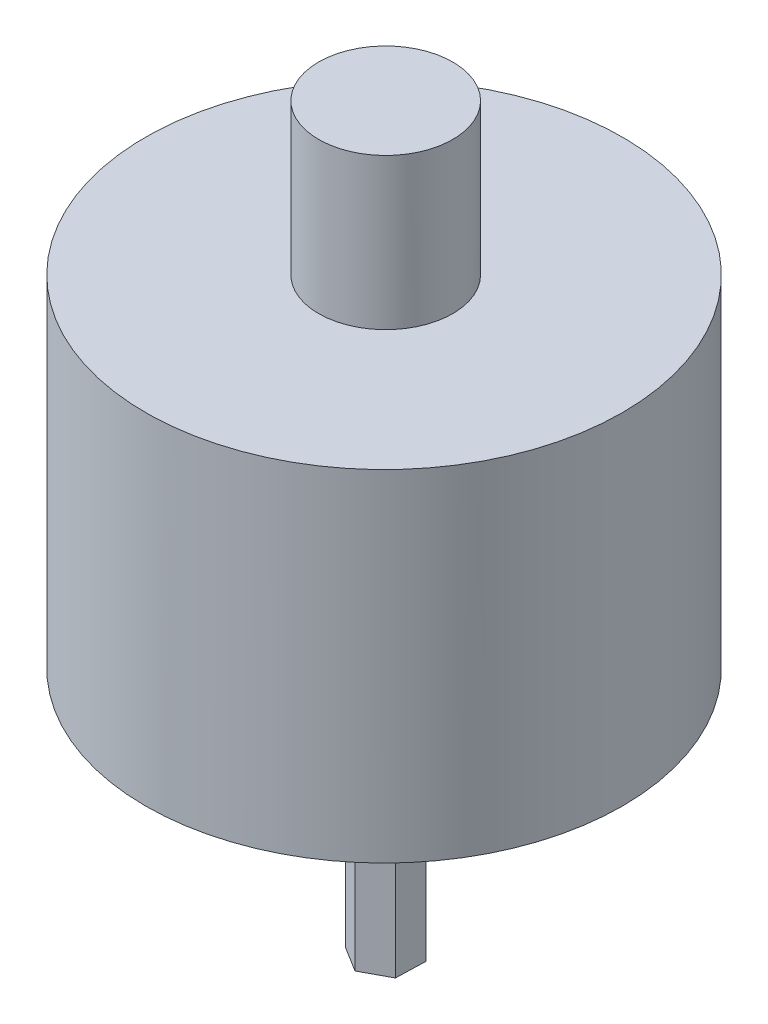
ISO-10303-21;
HEADER;
FILE_DESCRIPTION(('STEP AP214'),'2;1');
FILE_NAME('part.step','',(''),(''),'','','');
FILE_SCHEMA(('AUTOMOTIVE_DESIGN { 1 0 10303 214 1 1 1 1 }'));
ENDSEC;
DATA;
#1=APPLICATION_CONTEXT('core data for automotive mechanical design processes');
#2=APPLICATION_PROTOCOL_DEFINITION('international standard','automotive_design',2000,#1);
#3=PRODUCT_CONTEXT('',#1,'mechanical');
#4=PRODUCT('Part','Part','',(#3));
#5=PRODUCT_RELATED_PRODUCT_CATEGORY('part','',(#4));
#6=PRODUCT_DEFINITION_FORMATION('','',#4);
#7=PRODUCT_DEFINITION_CONTEXT('part definition',#1,'design');
#8=PRODUCT_DEFINITION('design','',#6,#7);
#9=PRODUCT_DEFINITION_SHAPE('','',#8);
#10=(LENGTH_UNIT() NAMED_UNIT(*) SI_UNIT(.MILLI.,.METRE.));
#11=(NAMED_UNIT(*) PLANE_ANGLE_UNIT() SI_UNIT($,.RADIAN.));
#12=(NAMED_UNIT(*) SI_UNIT($,.STERADIAN.) SOLID_ANGLE_UNIT());
#13=UNCERTAINTY_MEASURE_WITH_UNIT(LENGTH_MEASURE(1.E-05),#10,'distance_accuracy_value','');
#14=(GEOMETRIC_REPRESENTATION_CONTEXT(3) GLOBAL_UNCERTAINTY_ASSIGNED_CONTEXT((#13)) GLOBAL_UNIT_ASSIGNED_CONTEXT((#10,
#11,#12)) REPRESENTATION_CONTEXT('',''));
#15=CARTESIAN_POINT('',(0.,0.,0.));
#16=DIRECTION('',(0.,0.,1.));
#17=DIRECTION('',(1.,0.,0.));
#18=AXIS2_PLACEMENT_3D('',#15,#16,#17);
#19=CARTESIAN_POINT('',(16.1852771436169,10.9660934082422,12.6120088485756));
#20=DIRECTION('',(0.525684598535704,0.,-0.850679553570177));
#21=DIRECTION('',(-0.850679553570177,0.,-0.525684598535704));
#22=AXIS2_PLACEMENT_3D('',#19,#20,#21);
#23=PLANE('',#22);
#24=DIRECTION('',(0.850679553570177,0.,0.525684598535704));
#25=VECTOR('',#24,1.);
#26=CARTESIAN_POINT('',(16.1852771436169,8.30499999999998,12.6120088485756));
#27=LINE('',#26,#25);
#28=CARTESIAN_POINT('',(16.1852771436169,8.30499999999998,12.6120088485756));
#29=VERTEX_POINT('',#28);
#30=CARTESIAN_POINT('',(17.0349494634157,8.30499999999998,13.1370710185146));
#31=VERTEX_POINT('',#30);
#32=EDGE_CURVE('E123',#29,#31,#27,.T.);
#33=ORIENTED_EDGE('',*,*,#32,.F.);
#34=DIRECTION('',(0.,-1.,0.));
#35=VECTOR('',#34,1.);
#36=CARTESIAN_POINT('',(16.1852771436169,10.9660934082422,12.6120088485756));
#37=LINE('',#36,#35);
#38=CARTESIAN_POINT('',(16.1852771436169,0.,12.6120088485756));
#39=VERTEX_POINT('',#38);
#40=EDGE_CURVE('E42',#29,#39,#37,.T.);
#41=ORIENTED_EDGE('',*,*,#40,.T.);
#42=DIRECTION('',(0.850679553570177,0.,0.525684598535704));
#43=VECTOR('',#42,1.);
#44=CARTESIAN_POINT('',(16.1852771436169,0.,12.6120088485756));
#45=LINE('',#44,#43);
#46=CARTESIAN_POINT('',(17.0349494634157,0.,13.1370710185146));
#47=VERTEX_POINT('',#46);
#48=EDGE_CURVE('E131',#39,#47,#45,.T.);
#49=ORIENTED_EDGE('',*,*,#48,.T.);
#50=DIRECTION('',(0.,-1.,0.));
#51=VECTOR('',#50,1.);
#52=CARTESIAN_POINT('',(17.0349494634157,10.9660934082422,13.1370710185146));
#53=LINE('',#52,#51);
#54=EDGE_CURVE('E83',#31,#47,#53,.T.);
#55=ORIENTED_EDGE('',*,*,#54,.F.);
#56=EDGE_LOOP('',(#33,#41,#49,#55));
#57=FACE_BOUND('',#56,.T.);
#58=ADVANCED_FACE('F39',(#57),#23,.F.);
#59=CARTESIAN_POINT('',(17.0349494634157,10.9660934082422,13.1370710185146));
#60=DIRECTION('',(-0.473867804603926,0.,-0.880595993495232));
#61=DIRECTION('',(-0.880595993495232,0.,0.473867804603926));
#62=AXIS2_PLACEMENT_3D('',#59,#60,#61);
#63=PLANE('',#62);
#64=DIRECTION('',(0.880595993495232,0.,-0.473867804603926));
#65=VECTOR('',#64,1.);
#66=CARTESIAN_POINT('',(17.0349494634157,8.30499999999998,13.1370710185146));
#67=LINE('',#66,#65);
#68=CARTESIAN_POINT('',(17.9145028010484,8.30499999999998,12.663764289646));
#69=VERTEX_POINT('',#68);
#70=EDGE_CURVE('E90',#31,#69,#67,.T.);
#71=ORIENTED_EDGE('',*,*,#70,.F.);
#72=ORIENTED_EDGE('',*,*,#54,.T.);
#73=DIRECTION('',(0.880595993495232,0.,-0.473867804603926));
#74=VECTOR('',#73,1.);
#75=CARTESIAN_POINT('',(17.0349494634157,0.,13.1370710185146));
#76=LINE('',#75,#74);
#77=CARTESIAN_POINT('',(17.9145028010484,0.,12.663764289646));
#78=VERTEX_POINT('',#77);
#79=EDGE_CURVE('E130',#47,#78,#76,.T.);
#80=ORIENTED_EDGE('',*,*,#79,.T.);
#81=DIRECTION('',(0.,-1.,0.));
#82=VECTOR('',#81,1.);
#83=CARTESIAN_POINT('',(17.9145028010484,10.9660934082422,12.663764289646));
#84=LINE('',#83,#82);
#85=EDGE_CURVE('E132',#69,#78,#84,.T.);
#86=ORIENTED_EDGE('',*,*,#85,.F.);
#87=EDGE_LOOP('',(#71,#72,#80,#86));
#88=FACE_BOUND('',#87,.T.);
#89=ADVANCED_FACE('F175',(#88),#63,.F.);
#90=CARTESIAN_POINT('',(17.9145028010484,10.9660934082422,12.663764289646));
#91=DIRECTION('',(-0.999552403139631,0.,-0.0299164399250569));
#92=DIRECTION('',(-0.0299164399250569,0.,0.999552403139631));
#93=AXIS2_PLACEMENT_3D('',#90,#91,#92);
#94=PLANE('',#93);
#95=DIRECTION('',(0.0299164399250569,0.,-0.999552403139631));
#96=VECTOR('',#95,1.);
#97=CARTESIAN_POINT('',(17.9145028010484,8.30499999999998,12.663764289646));
#98=LINE('',#97,#96);
#99=CARTESIAN_POINT('',(17.9443838188824,8.30499999999998,11.6653953908382));
#100=VERTEX_POINT('',#99);
#101=EDGE_CURVE('E117',#69,#100,#98,.T.);
#102=ORIENTED_EDGE('',*,*,#101,.F.);
#103=ORIENTED_EDGE('',*,*,#85,.T.);
#104=DIRECTION('',(0.0299164399250569,0.,-0.999552403139631));
#105=VECTOR('',#104,1.);
#106=CARTESIAN_POINT('',(17.9145028010484,0.,12.663764289646));
#107=LINE('',#106,#105);
#108=CARTESIAN_POINT('',(17.9443838188824,0.,11.6653953908382));
#109=VERTEX_POINT('',#108);
#110=EDGE_CURVE('E134',#78,#109,#107,.T.);
#111=ORIENTED_EDGE('',*,*,#110,.T.);
#112=DIRECTION('',(0.,-1.,0.));
#113=VECTOR('',#112,1.);
#114=CARTESIAN_POINT('',(17.9443838188824,10.9660934082422,11.6653953908382));
#115=LINE('',#114,#113);
#116=EDGE_CURVE('E135',#100,#109,#115,.T.);
#117=ORIENTED_EDGE('',*,*,#116,.F.);
#118=EDGE_LOOP('',(#102,#103,#111,#117));
#119=FACE_BOUND('',#118,.T.);
#120=ADVANCED_FACE('F180',(#119),#94,.F.);
#121=CARTESIAN_POINT('',(17.9443838188824,10.9660934082422,11.6653953908382));
#122=DIRECTION('',(-0.525684598535703,0.,0.850679553570177));
#123=DIRECTION('',(0.850679553570177,0.,0.525684598535703));
#124=AXIS2_PLACEMENT_3D('',#121,#122,#123);
#125=PLANE('',#124);
#126=DIRECTION('',(-0.850679553570177,0.,-0.525684598535703));
#127=VECTOR('',#126,1.);
#128=CARTESIAN_POINT('',(17.9443838188824,8.30499999999998,11.6653953908382));
#129=LINE('',#128,#127);
#130=CARTESIAN_POINT('',(17.0947114990836,8.30499999999998,11.1403332208992));
#131=VERTEX_POINT('',#130);
#132=EDGE_CURVE('E105',#100,#131,#129,.T.);
#133=ORIENTED_EDGE('',*,*,#132,.F.);
#134=ORIENTED_EDGE('',*,*,#116,.T.);
#135=DIRECTION('',(-0.850679553570177,0.,-0.525684598535703));
#136=VECTOR('',#135,1.);
#137=CARTESIAN_POINT('',(17.9443838188824,0.,11.6653953908382));
#138=LINE('',#137,#136);
#139=CARTESIAN_POINT('',(17.0947114990836,0.,11.1403332208992));
#140=VERTEX_POINT('',#139);
#141=EDGE_CURVE('E111',#109,#140,#138,.T.);
#142=ORIENTED_EDGE('',*,*,#141,.T.);
#143=DIRECTION('',(0.,-1.,0.));
#144=VECTOR('',#143,1.);
#145=CARTESIAN_POINT('',(17.0947114990836,10.9660934082422,11.1403332208992));
#146=LINE('',#145,#144);
#147=EDGE_CURVE('E100',#131,#140,#146,.T.);
#148=ORIENTED_EDGE('',*,*,#147,.F.);
#149=EDGE_LOOP('',(#133,#134,#142,#148));
#150=FACE_BOUND('',#149,.T.);
#151=ADVANCED_FACE('F108',(#150),#125,.F.);
#152=CARTESIAN_POINT('',(17.0947114990836,10.9660934082422,11.1403332208992));
#153=DIRECTION('',(0.473867804603926,0.,0.880595993495232));
#154=DIRECTION('',(0.880595993495232,0.,-0.473867804603926));
#155=AXIS2_PLACEMENT_3D('',#152,#153,#154);
#156=PLANE('',#155);
#157=DIRECTION('',(-0.880595993495232,0.,0.473867804603926));
#158=VECTOR('',#157,1.);
#159=CARTESIAN_POINT('',(17.0947114990836,8.30499999999998,11.1403332208992));
#160=LINE('',#159,#158);
#161=CARTESIAN_POINT('',(16.2151581614509,8.30499999999998,11.6136399497679));
#162=VERTEX_POINT('',#161);
#163=EDGE_CURVE('E47',#131,#162,#160,.T.);
#164=ORIENTED_EDGE('',*,*,#163,.F.);
#165=ORIENTED_EDGE('',*,*,#147,.T.);
#166=DIRECTION('',(-0.880595993495232,0.,0.473867804603926));
#167=VECTOR('',#166,1.);
#168=CARTESIAN_POINT('',(17.0947114990836,0.,11.1403332208992));
#169=LINE('',#168,#167);
#170=CARTESIAN_POINT('',(16.2151581614509,0.,11.6136399497679));
#171=VERTEX_POINT('',#170);
#172=EDGE_CURVE('E113',#140,#171,#169,.T.);
#173=ORIENTED_EDGE('',*,*,#172,.T.);
#174=DIRECTION('',(0.,-1.,0.));
#175=VECTOR('',#174,1.);
#176=CARTESIAN_POINT('',(16.2151581614509,10.9660934082422,11.6136399497679));
#177=LINE('',#176,#175);
#178=EDGE_CURVE('E60',#162,#171,#177,.T.);
#179=ORIENTED_EDGE('',*,*,#178,.F.);
#180=EDGE_LOOP('',(#164,#165,#173,#179));
#181=FACE_BOUND('',#180,.T.);
#182=ADVANCED_FACE('F99',(#181),#156,.F.);
#183=CARTESIAN_POINT('',(16.2151581614509,10.9660934082422,11.6136399497679));
#184=DIRECTION('',(0.999552403139631,0.,0.0299164399250571));
#185=DIRECTION('',(0.0299164399250571,0.,-0.999552403139631));
#186=AXIS2_PLACEMENT_3D('',#183,#184,#185);
#187=PLANE('',#186);
#188=DIRECTION('',(-0.0299164399250571,0.,0.999552403139631));
#189=VECTOR('',#188,1.);
#190=CARTESIAN_POINT('',(16.2151581614509,8.30499999999998,11.6136399497679));
#191=LINE('',#190,#189);
#192=EDGE_CURVE('E126',#162,#29,#191,.T.);
#193=ORIENTED_EDGE('',*,*,#192,.F.);
#194=ORIENTED_EDGE('',*,*,#178,.T.);
#195=DIRECTION('',(-0.0299164399250571,0.,0.999552403139631));
#196=VECTOR('',#195,1.);
#197=CARTESIAN_POINT('',(16.2151581614509,0.,11.6136399497679));
#198=LINE('',#197,#196);
#199=EDGE_CURVE('E128',#171,#39,#198,.T.);
#200=ORIENTED_EDGE('',*,*,#199,.T.);
#201=ORIENTED_EDGE('',*,*,#40,.F.);
#202=EDGE_LOOP('',(#193,#194,#200,#201));
#203=FACE_BOUND('',#202,.T.);
#204=ADVANCED_FACE('F181',(#203),#187,.F.);
#205=CARTESIAN_POINT('',(0.,0.,0.));
#206=DIRECTION('',(0.,1.,0.));
#207=DIRECTION('',(0.,0.,1.));
#208=AXIS2_PLACEMENT_3D('',#205,#206,#207);
#209=PLANE('',#208);
#210=ORIENTED_EDGE('',*,*,#48,.F.);
#211=ORIENTED_EDGE('',*,*,#199,.F.);
#212=ORIENTED_EDGE('',*,*,#172,.F.);
#213=ORIENTED_EDGE('',*,*,#141,.F.);
#214=ORIENTED_EDGE('',*,*,#110,.F.);
#215=ORIENTED_EDGE('',*,*,#79,.F.);
#216=EDGE_LOOP('',(#210,#211,#212,#213,#214,#215));
#217=FACE_BOUND('',#216,.T.);
#218=ADVANCED_FACE('F183',(#217),#209,.F.);
#219=CARTESIAN_POINT('',(17.0349494634157,8.30499999999999,12.1645798402421));
#220=DIRECTION('',(0.,1.,0.));
#221=DIRECTION('',(0.,0.,1.));
#222=AXIS2_PLACEMENT_3D('',#219,#220,#221);
#223=PLANE('',#222);
#224=CARTESIAN_POINT('',(17.0349494634157,8.30499999999999,12.1645798402421));
#225=DIRECTION('',(0.,1.,0.));
#226=DIRECTION('',(0.,0.,1.));
#227=AXIS2_PLACEMENT_3D('',#224,#225,#226);
#228=CIRCLE('',#227,8.);
#229=CARTESIAN_POINT('',(17.0349494634157,8.30499999999999,20.1645798402421));
#230=VERTEX_POINT('',#229);
#231=EDGE_CURVE('E149',#230,#230,#228,.T.);
#232=ORIENTED_EDGE('',*,*,#231,.F.);
#233=EDGE_LOOP('',(#232));
#234=FACE_BOUND('',#233,.T.);
#235=ORIENTED_EDGE('',*,*,#163,.T.);
#236=ORIENTED_EDGE('',*,*,#192,.T.);
#237=ORIENTED_EDGE('',*,*,#32,.T.);
#238=ORIENTED_EDGE('',*,*,#70,.T.);
#239=ORIENTED_EDGE('',*,*,#101,.T.);
#240=ORIENTED_EDGE('',*,*,#132,.T.);
#241=EDGE_LOOP('',(#235,#236,#237,#238,#239,#240));
#242=FACE_BOUND('',#241,.T.);
#243=ADVANCED_FACE('F116',(#234,#242),#223,.F.);
#244=CARTESIAN_POINT('',(17.0349494634157,42.3624169979695,12.1645798402421));
#245=DIRECTION('',(0.,-1.,0.));
#246=DIRECTION('',(0.,0.,-1.));
#247=AXIS2_PLACEMENT_3D('',#244,#245,#246);
#248=CYLINDRICAL_SURFACE('',#247,8.);
#249=CARTESIAN_POINT('',(17.0349494634157,19.735,12.1645798402421));
#250=DIRECTION('',(0.,-1.,0.));
#251=DIRECTION('',(1.,0.,0.));
#252=AXIS2_PLACEMENT_3D('',#249,#250,#251);
#253=CIRCLE('',#252,8.);
#254=CARTESIAN_POINT('',(25.0349494634157,19.735,12.1645798402421));
#255=VERTEX_POINT('',#254);
#256=EDGE_CURVE('E147',#255,#255,#253,.T.);
#257=ORIENTED_EDGE('',*,*,#256,.T.);
#258=EDGE_LOOP('',(#257));
#259=FACE_BOUND('',#258,.T.);
#260=ORIENTED_EDGE('',*,*,#231,.T.);
#261=EDGE_LOOP('',(#260));
#262=FACE_BOUND('',#261,.T.);
#263=ADVANCED_FACE('F171',(#259,#262),#248,.T.);
#264=CARTESIAN_POINT('',(4.19889391853285,19.735,10.4089112756606));
#265=DIRECTION('',(0.,-1.,0.));
#266=DIRECTION('',(0.880595993495231,0.,-0.473867804603928));
#267=AXIS2_PLACEMENT_3D('',#264,#265,#266);
#268=PLANE('',#267);
#269=CARTESIAN_POINT('',(17.0648304812497,19.735,12.1387021197069));
#270=DIRECTION('',(0.,1.,0.));
#271=DIRECTION('',(0.,0.,1.));
#272=AXIS2_PLACEMENT_3D('',#269,#270,#271);
#273=CIRCLE('',#272,2.25);
#274=CARTESIAN_POINT('',(17.0648304812497,19.735,14.3887021197069));
#275=VERTEX_POINT('',#274);
#276=EDGE_CURVE('E11',#275,#275,#273,.T.);
#277=ORIENTED_EDGE('',*,*,#276,.F.);
#278=EDGE_LOOP('',(#277));
#279=FACE_BOUND('',#278,.T.);
#280=ORIENTED_EDGE('',*,*,#256,.F.);
#281=EDGE_LOOP('',(#280));
#282=FACE_BOUND('',#281,.T.);
#283=ADVANCED_FACE('F163',(#279,#282),#268,.F.);
#284=CARTESIAN_POINT('',(17.0648304812497,31.1589610306789,12.1387021197069));
#285=DIRECTION('',(0.,-1.,0.));
#286=DIRECTION('',(0.,0.,-1.));
#287=AXIS2_PLACEMENT_3D('',#284,#285,#286);
#288=CYLINDRICAL_SURFACE('',#287,2.25);
#289=ORIENTED_EDGE('',*,*,#276,.T.);
#290=EDGE_LOOP('',(#289));
#291=FACE_BOUND('',#290,.T.);
#292=CARTESIAN_POINT('',(17.0648304812497,24.795,12.1387021197069));
#293=DIRECTION('',(0.,1.,0.));
#294=DIRECTION('',(-1.,0.,0.));
#295=AXIS2_PLACEMENT_3D('',#292,#293,#294);
#296=CIRCLE('',#295,2.25);
#297=CARTESIAN_POINT('',(14.8148304812497,24.795,12.1387021197069));
#298=VERTEX_POINT('',#297);
#299=EDGE_CURVE('E153',#298,#298,#296,.T.);
#300=ORIENTED_EDGE('',*,*,#299,.F.);
#301=EDGE_LOOP('',(#300));
#302=FACE_BOUND('',#301,.T.);
#303=ADVANCED_FACE('F161',(#291,#302),#288,.T.);
#304=CARTESIAN_POINT('',(15.477276645133,24.795,14.696391079966));
#305=DIRECTION('',(0.,1.,0.));
#306=DIRECTION('',(-0.880595993495231,0.,0.473867804603928));
#307=AXIS2_PLACEMENT_3D('',#304,#305,#306);
#308=PLANE('',#307);
#309=ORIENTED_EDGE('',*,*,#299,.T.);
#310=EDGE_LOOP('',(#309));
#311=FACE_BOUND('',#310,.T.);
#312=ADVANCED_FACE('F159',(#311),#308,.T.);
#313=CLOSED_SHELL('',(#58,#89,#120,#151,#182,#204,#218,#243,#263,#283,#303,#312));
#314=MANIFOLD_SOLID_BREP('B2',#313);
#315=ADVANCED_BREP_SHAPE_REPRESENTATION('',(#18,#314),#14);
#316=SHAPE_DEFINITION_REPRESENTATION(#9,#315);
ENDSEC;
END-ISO-10303-21;
